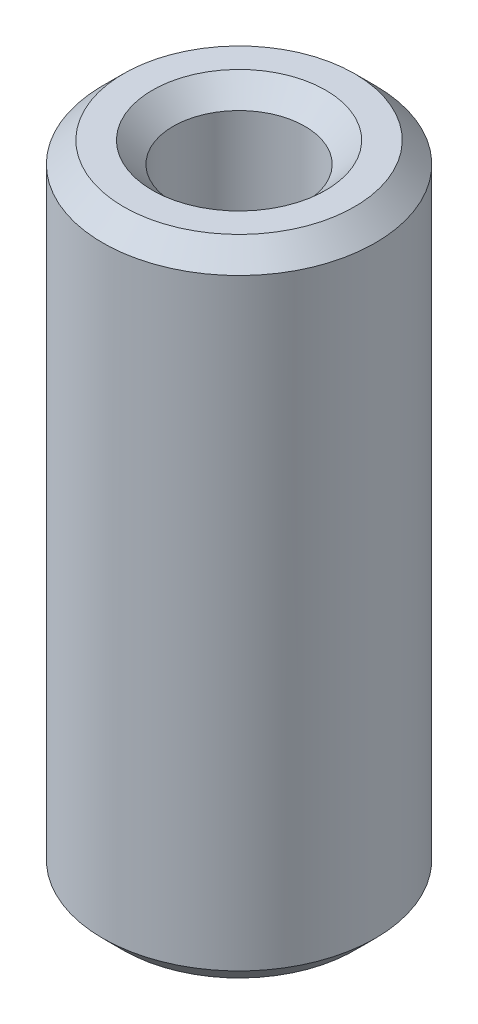
ISO-10303-21;
HEADER;
FILE_DESCRIPTION(('STEP AP214'),'2;1');
FILE_NAME('part.step','',(''),(''),'','','');
FILE_SCHEMA(('AUTOMOTIVE_DESIGN { 1 0 10303 214 1 1 1 1 }'));
ENDSEC;
DATA;
#1=APPLICATION_CONTEXT('core data for automotive mechanical design processes');
#2=APPLICATION_PROTOCOL_DEFINITION('international standard','automotive_design',2000,#1);
#3=PRODUCT_CONTEXT('',#1,'mechanical');
#4=PRODUCT('Part','Part','',(#3));
#5=PRODUCT_RELATED_PRODUCT_CATEGORY('part','',(#4));
#6=PRODUCT_DEFINITION_FORMATION('','',#4);
#7=PRODUCT_DEFINITION_CONTEXT('part definition',#1,'design');
#8=PRODUCT_DEFINITION('design','',#6,#7);
#9=PRODUCT_DEFINITION_SHAPE('','',#8);
#10=(LENGTH_UNIT() NAMED_UNIT(*) SI_UNIT(.MILLI.,.METRE.));
#11=(NAMED_UNIT(*) PLANE_ANGLE_UNIT() SI_UNIT($,.RADIAN.));
#12=(NAMED_UNIT(*) SI_UNIT($,.STERADIAN.) SOLID_ANGLE_UNIT());
#13=UNCERTAINTY_MEASURE_WITH_UNIT(LENGTH_MEASURE(1.E-05),#10,'distance_accuracy_value','');
#14=(GEOMETRIC_REPRESENTATION_CONTEXT(3) GLOBAL_UNCERTAINTY_ASSIGNED_CONTEXT((#13)) GLOBAL_UNIT_ASSIGNED_CONTEXT((#10,
#11,#12)) REPRESENTATION_CONTEXT('',''));
#15=CARTESIAN_POINT('',(0.,0.,0.));
#16=DIRECTION('',(0.,0.,1.));
#17=DIRECTION('',(1.,0.,0.));
#18=AXIS2_PLACEMENT_3D('',#15,#16,#17);
#19=CARTESIAN_POINT('',(0.,23.6281511873177,0.));
#20=DIRECTION('',(0.,-1.,0.));
#21=DIRECTION('',(0.,0.,-1.));
#22=AXIS2_PLACEMENT_3D('',#19,#20,#21);
#23=CYLINDRICAL_SURFACE('',#22,5.);
#24=CARTESIAN_POINT('',(0.,0.764984297765083,0.));
#25=DIRECTION('',(0.,1.,0.));
#26=DIRECTION('',(0.,0.,1.));
#27=AXIS2_PLACEMENT_3D('',#24,#25,#26);
#28=CIRCLE('',#27,5.);
#29=CARTESIAN_POINT('',(0.,0.764984297765083,5.));
#30=VERTEX_POINT('',#29);
#31=EDGE_CURVE('E10',#30,#30,#28,.T.);
#32=ORIENTED_EDGE('',*,*,#31,.T.);
#33=EDGE_LOOP('',(#32));
#34=FACE_BOUND('',#33,.T.);
#35=CARTESIAN_POINT('',(0.,22.8631668895526,0.));
#36=DIRECTION('',(0.,1.,0.));
#37=DIRECTION('',(0.,0.,1.));
#38=AXIS2_PLACEMENT_3D('',#35,#36,#37);
#39=CIRCLE('',#38,5.);
#40=CARTESIAN_POINT('',(0.,22.8631668895526,-5.));
#41=VERTEX_POINT('',#40);
#42=EDGE_CURVE('E50',#41,#41,#39,.F.);
#43=ORIENTED_EDGE('',*,*,#42,.T.);
#44=EDGE_LOOP('',(#43));
#45=FACE_BOUND('',#44,.T.);
#46=ADVANCED_FACE('F39',(#34,#45),#23,.T.);
#47=CARTESIAN_POINT('',(0.,23.6281511873177,0.));
#48=DIRECTION('',(0.,1.,0.));
#49=DIRECTION('',(0.,0.,1.));
#50=AXIS2_PLACEMENT_3D('',#47,#48,#49);
#51=PLANE('',#50);
#52=CARTESIAN_POINT('',(0.,23.6281511873177,0.));
#53=DIRECTION('',(0.,1.,0.));
#54=DIRECTION('',(0.,0.,1.));
#55=AXIS2_PLACEMENT_3D('',#52,#53,#54);
#56=CIRCLE('',#55,3.18186007579578);
#57=CARTESIAN_POINT('',(0.,23.6281511873177,3.18186007579578));
#58=VERTEX_POINT('',#57);
#59=EDGE_CURVE('E58',#58,#58,#56,.F.);
#60=ORIENTED_EDGE('',*,*,#59,.T.);
#61=EDGE_LOOP('',(#60));
#62=FACE_BOUND('',#61,.T.);
#63=CARTESIAN_POINT('',(0.,23.6281511873177,0.));
#64=DIRECTION('',(0.,1.,0.));
#65=DIRECTION('',(0.,0.,1.));
#66=AXIS2_PLACEMENT_3D('',#63,#64,#65);
#67=CIRCLE('',#66,4.23501570223493);
#68=CARTESIAN_POINT('',(0.,23.6281511873177,-4.23501570223493));
#69=VERTEX_POINT('',#68);
#70=EDGE_CURVE('E61',#69,#69,#67,.T.);
#71=ORIENTED_EDGE('',*,*,#70,.T.);
#72=EDGE_LOOP('',(#71));
#73=FACE_BOUND('',#72,.T.);
#74=ADVANCED_FACE('F88',(#62,#73),#51,.T.);
#75=CARTESIAN_POINT('',(0.,0.,0.));
#76=DIRECTION('',(0.,1.,0.));
#77=DIRECTION('',(0.,0.,1.));
#78=AXIS2_PLACEMENT_3D('',#75,#76,#77);
#79=PLANE('',#78);
#80=CARTESIAN_POINT('',(0.,0.,0.));
#81=DIRECTION('',(0.,1.,0.));
#82=DIRECTION('',(0.,0.,1.));
#83=AXIS2_PLACEMENT_3D('',#80,#81,#82);
#84=CIRCLE('',#83,3.18186007579577);
#85=CARTESIAN_POINT('',(0.,0.,3.18186007579577));
#86=VERTEX_POINT('',#85);
#87=EDGE_CURVE('E51',#86,#86,#84,.T.);
#88=ORIENTED_EDGE('',*,*,#87,.T.);
#89=EDGE_LOOP('',(#88));
#90=FACE_BOUND('',#89,.T.);
#91=CARTESIAN_POINT('',(0.,0.,0.));
#92=DIRECTION('',(0.,1.,0.));
#93=DIRECTION('',(0.,0.,1.));
#94=AXIS2_PLACEMENT_3D('',#91,#92,#93);
#95=CIRCLE('',#94,4.23501570223491);
#96=CARTESIAN_POINT('',(0.,0.,4.23501570223491));
#97=VERTEX_POINT('',#96);
#98=EDGE_CURVE('E54',#97,#97,#95,.F.);
#99=ORIENTED_EDGE('',*,*,#98,.T.);
#100=EDGE_LOOP('',(#99));
#101=FACE_BOUND('',#100,.T.);
#102=ADVANCED_FACE('F83',(#90,#101),#79,.F.);
#103=CARTESIAN_POINT('',(0.,23.6281511873177,0.));
#104=DIRECTION('',(0.,-1.,0.));
#105=DIRECTION('',(0.,0.,-1.));
#106=AXIS2_PLACEMENT_3D('',#103,#104,#105);
#107=CYLINDRICAL_SURFACE('',#106,2.41687577803069);
#108=CARTESIAN_POINT('',(0.,22.8631668895526,0.));
#109=DIRECTION('',(0.,1.,0.));
#110=DIRECTION('',(0.,0.,1.));
#111=AXIS2_PLACEMENT_3D('',#108,#109,#110);
#112=CIRCLE('',#111,2.41687577803069);
#113=CARTESIAN_POINT('',(0.,22.8631668895526,2.41687577803069));
#114=VERTEX_POINT('',#113);
#115=EDGE_CURVE('E67',#114,#114,#112,.T.);
#116=ORIENTED_EDGE('',*,*,#115,.T.);
#117=EDGE_LOOP('',(#116));
#118=FACE_BOUND('',#117,.T.);
#119=CARTESIAN_POINT('',(0.,0.764984297765087,0.));
#120=DIRECTION('',(0.,1.,0.));
#121=DIRECTION('',(0.,0.,1.));
#122=AXIS2_PLACEMENT_3D('',#119,#120,#121);
#123=CIRCLE('',#122,2.41687577803069);
#124=CARTESIAN_POINT('',(0.,0.764984297765087,2.41687577803069));
#125=VERTEX_POINT('',#124);
#126=EDGE_CURVE('E69',#125,#125,#123,.F.);
#127=ORIENTED_EDGE('',*,*,#126,.T.);
#128=EDGE_LOOP('',(#127));
#129=FACE_BOUND('',#128,.T.);
#130=ADVANCED_FACE('F71',(#118,#129),#107,.F.);
#131=CARTESIAN_POINT('',(0.,22.8631668895526,0.));
#132=DIRECTION('',(0.,1.,0.));
#133=DIRECTION('',(0.,0.,1.));
#134=AXIS2_PLACEMENT_3D('',#131,#132,#133);
#135=CONICAL_SURFACE('',#134,2.41687577803069,0.785398163397455);
#136=CARTESIAN_POINT('',(0.,23.6281511873177,3.18186007579578));
#137=CARTESIAN_POINT('',(0.,23.6201826008827,3.17389148936072));
#138=CARTESIAN_POINT('',(0.,23.6122140144476,3.16592290292567));
#139=CARTESIAN_POINT('',(0.,23.5962768415775,3.14998573005556));
#140=CARTESIAN_POINT('',(0.,23.5883082551425,3.14201714362051));
#141=CARTESIAN_POINT('',(0.,23.5723710822724,3.1260799707504));
#142=CARTESIAN_POINT('',(0.,23.5644024958373,3.11811138431535));
#143=CARTESIAN_POINT('',(0.,23.5484653229672,3.10217421144525));
#144=CARTESIAN_POINT('',(0.,23.5404967365321,3.09420562501019));
#145=CARTESIAN_POINT('',(0.,23.524559563662,3.07826845214009));
#146=CARTESIAN_POINT('',(0.,23.516590977227,3.07029986570503));
#147=CARTESIAN_POINT('',(0.,23.5006538043569,3.05436269283493));
#148=CARTESIAN_POINT('',(0.,23.4926852179218,3.04639410639987));
#149=CARTESIAN_POINT('',(0.,23.4767480450517,3.03045693352977));
#150=CARTESIAN_POINT('',(0.,23.4687794586167,3.02248834709472));
#151=CARTESIAN_POINT('',(0.,23.4528422857466,3.00655117422461));
#152=CARTESIAN_POINT('',(0.,23.4448736993115,2.99858258778956));
#153=CARTESIAN_POINT('',(0.,23.4289365264414,2.98264541491945));
#154=CARTESIAN_POINT('',(0.,23.4209679400063,2.9746768284844));
#155=CARTESIAN_POINT('',(0.,23.4050307671362,2.95873965561429));
#156=CARTESIAN_POINT('',(0.,23.3970621807012,2.95077106917924));
#157=CARTESIAN_POINT('',(0.,23.3811250078311,2.93483389630913));
#158=CARTESIAN_POINT('',(0.,23.373156421396,2.92686530987408));
#159=CARTESIAN_POINT('',(0.,23.3572192485259,2.91092813700397));
#160=CARTESIAN_POINT('',(0.,23.3492506620909,2.90295955056892));
#161=CARTESIAN_POINT('',(0.,23.3333134892208,2.88702237769882));
#162=CARTESIAN_POINT('',(0.,23.3253449027857,2.87905379126376));
#163=CARTESIAN_POINT('',(0.,23.3094077299156,2.86311661839366));
#164=CARTESIAN_POINT('',(0.,23.3014391434806,2.8551480319586));
#165=CARTESIAN_POINT('',(0.,23.2855019706104,2.8392108590885));
#166=CARTESIAN_POINT('',(0.,23.2775333841754,2.83124227265344));
#167=CARTESIAN_POINT('',(0.,23.2615962113053,2.81530509978334));
#168=CARTESIAN_POINT('',(0.,23.2536276248702,2.80733651334829));
#169=CARTESIAN_POINT('',(0.,23.2376904520001,2.79139934047818));
#170=CARTESIAN_POINT('',(0.,23.2297218655651,2.78343075404313));
#171=CARTESIAN_POINT('',(0.,23.213784692695,2.76749358117302));
#172=CARTESIAN_POINT('',(0.,23.2058161062599,2.75952499473797));
#173=CARTESIAN_POINT('',(0.,23.1898789333898,2.74358782186786));
#174=CARTESIAN_POINT('',(0.,23.1819103469548,2.73561923543281));
#175=CARTESIAN_POINT('',(0.,23.1659731740847,2.7196820625627));
#176=CARTESIAN_POINT('',(0.,23.1580045876496,2.71171347612765));
#177=CARTESIAN_POINT('',(0.,23.1420674147795,2.69577630325754));
#178=CARTESIAN_POINT('',(0.,23.1340988283444,2.68780771682249));
#179=CARTESIAN_POINT('',(0.,23.1181616554743,2.67187054395238));
#180=CARTESIAN_POINT('',(0.,23.1101930690393,2.66390195751733));
#181=CARTESIAN_POINT('',(0.,23.0942558961692,2.64796478464723));
#182=CARTESIAN_POINT('',(0.,23.0862873097341,2.63999619821217));
#183=CARTESIAN_POINT('',(0.,23.070350136864,2.62405902534207));
#184=CARTESIAN_POINT('',(0.,23.062381550429,2.61609043890701));
#185=CARTESIAN_POINT('',(0.,23.0464443775589,2.60015326603691));
#186=CARTESIAN_POINT('',(0.,23.0384757911238,2.59218467960185));
#187=CARTESIAN_POINT('',(0.,23.0225386182537,2.57624750673175));
#188=CARTESIAN_POINT('',(0.,23.0145700318186,2.5682789202967));
#189=CARTESIAN_POINT('',(0.,22.9986328589485,2.55234174742659));
#190=CARTESIAN_POINT('',(0.,22.9906642725135,2.54437316099154));
#191=CARTESIAN_POINT('',(0.,22.9747270996434,2.52843598812143));
#192=CARTESIAN_POINT('',(0.,22.9667585132083,2.52046740168638));
#193=CARTESIAN_POINT('',(0.,22.9508213403382,2.50453022881627));
#194=CARTESIAN_POINT('',(0.,22.9428527539032,2.49656164238122));
#195=CARTESIAN_POINT('',(0.,22.9269155810331,2.48062446951111));
#196=CARTESIAN_POINT('',(0.,22.918946994598,2.47265588307606));
#197=CARTESIAN_POINT('',(0.,22.9030098217279,2.45671871020595));
#198=CARTESIAN_POINT('',(0.,22.8950412352929,2.4487501237709));
#199=CARTESIAN_POINT('',(0.,22.8791040624228,2.4328129509008));
#200=CARTESIAN_POINT('',(0.,22.8711354759877,2.42484436446574));
#201=CARTESIAN_POINT('',(0.,22.8631668895526,2.41687577803069));
#202=B_SPLINE_CURVE_WITH_KNOTS('',3,(#136,#137,#138,#139,#140,#141,#142,#143,#144,#145,#146,
#147,#148,#149,#150,#151,#152,#153,#154,#155,#156,#157,#158,#159,#160,#161,#162,#163,#164,#165,
#166,#167,#168,#169,#170,#171,#172,#173,#174,#175,#176,#177,#178,#179,#180,#181,#182,#183,#184,
#185,#186,#187,#188,#189,#190,#191,#192,#193,#194,#195,#196,#197,#198,#199,#200,#201),
.UNSPECIFIED.,.F.,.F.,(4,2,2,2,2,2,2,2,2,2,2,2,2,2,2,2,2,2,2,2,2,2,2,2,2,2,2,2,2,2,2,2,4),(0.,
0.033807849028182,0.067615698056364,0.101423547084546,0.135231396112728,0.16903924514091,
0.202847094169092,0.236654943197276,0.270462792225458,0.304270641253641,0.338078490281823,
0.371886339310005,0.405694188338187,0.439502037366371,0.473309886394553,0.507117735422735,
0.540925584450917,0.574733433479099,0.608541282507281,0.642349131535463,0.676156980563648,
0.70996482959183,0.743772678620012,0.777580527648194,0.811388376676376,0.845196225704558,
0.879004074732742,0.912811923760924,0.946619772789106,0.980427621817288,1.01423547084547,
1.04804331987365,1.08185116890183),.UNSPECIFIED.);
#203=EDGE_CURVE('BSEAM77',#58,#114,#202,.T.);
#204=ORIENTED_EDGE('',*,*,#59,.F.);
#205=ORIENTED_EDGE('',*,*,#115,.F.);
#206=ORIENTED_EDGE('',*,*,#203,.T.);
#207=ORIENTED_EDGE('',*,*,#203,.F.);
#208=EDGE_LOOP('',(#204,#206,#205,#207));
#209=FACE_BOUND('',#208,.T.);
#210=ADVANCED_FACE('F77',(#209),#135,.F.);
#211=CARTESIAN_POINT('',(0.,0.,0.));
#212=DIRECTION('',(0.,-1.,0.));
#213=DIRECTION('',(0.,0.,-1.));
#214=AXIS2_PLACEMENT_3D('',#211,#212,#213);
#215=CONICAL_SURFACE('',#214,3.18186007579577,0.785398163397446);
#216=ORIENTED_EDGE('',*,*,#126,.F.);
#217=EDGE_LOOP('',(#216));
#218=FACE_BOUND('',#217,.T.);
#219=ORIENTED_EDGE('',*,*,#87,.F.);
#220=EDGE_LOOP('',(#219));
#221=FACE_BOUND('',#220,.T.);
#222=ADVANCED_FACE('F73',(#218,#221),#215,.F.);
#223=CARTESIAN_POINT('',(0.,0.764984297765083,0.));
#224=DIRECTION('',(0.,1.,0.));
#225=DIRECTION('',(0.,0.,1.));
#226=AXIS2_PLACEMENT_3D('',#223,#224,#225);
#227=CONICAL_SURFACE('',#226,5.,0.785398163397451);
#228=ORIENTED_EDGE('',*,*,#98,.F.);
#229=EDGE_LOOP('',(#228));
#230=FACE_BOUND('',#229,.T.);
#231=ORIENTED_EDGE('',*,*,#31,.F.);
#232=EDGE_LOOP('',(#231));
#233=FACE_BOUND('',#232,.T.);
#234=ADVANCED_FACE('F76',(#230,#233),#227,.T.);
#235=CARTESIAN_POINT('',(0.,23.6281511873177,0.));
#236=DIRECTION('',(0.,-1.,0.));
#237=DIRECTION('',(0.,0.,-1.));
#238=AXIS2_PLACEMENT_3D('',#235,#236,#237);
#239=CONICAL_SURFACE('',#238,4.23501570223493,0.785398163397445);
#240=CARTESIAN_POINT('',(0.,22.8631668895526,-5.));
#241=CARTESIAN_POINT('',(0.,22.8711354759877,-4.99203141356495));
#242=CARTESIAN_POINT('',(0.,22.8791040624227,-4.9840628271299));
#243=CARTESIAN_POINT('',(0.,22.8950412352929,-4.96812565425979));
#244=CARTESIAN_POINT('',(0.,22.9030098217279,-4.96015706782474));
#245=CARTESIAN_POINT('',(0.,22.918946994598,-4.94421989495463));
#246=CARTESIAN_POINT('',(0.,22.9269155810331,-4.93625130851958));
#247=CARTESIAN_POINT('',(0.,22.9428527539032,-4.92031413564947));
#248=CARTESIAN_POINT('',(0.,22.9508213403382,-4.91234554921442));
#249=CARTESIAN_POINT('',(0.,22.9667585132083,-4.89640837634431));
#250=CARTESIAN_POINT('',(0.,22.9747270996434,-4.88843978990926));
#251=CARTESIAN_POINT('',(0.,22.9906642725135,-4.87250261703916));
#252=CARTESIAN_POINT('',(0.,22.9986328589485,-4.8645340306041));
#253=CARTESIAN_POINT('',(0.,23.0145700318186,-4.848596857734));
#254=CARTESIAN_POINT('',(0.,23.0225386182537,-4.84062827129894));
#255=CARTESIAN_POINT('',(0.,23.0384757911238,-4.82469109842884));
#256=CARTESIAN_POINT('',(0.,23.0464443775589,-4.81672251199379));
#257=CARTESIAN_POINT('',(0.,23.062381550429,-4.80078533912368));
#258=CARTESIAN_POINT('',(0.,23.070350136864,-4.79281675268863));
#259=CARTESIAN_POINT('',(0.,23.0862873097341,-4.77687957981852));
#260=CARTESIAN_POINT('',(0.,23.0942558961692,-4.76891099338347));
#261=CARTESIAN_POINT('',(0.,23.1101930690393,-4.75297382051336));
#262=CARTESIAN_POINT('',(0.,23.1181616554743,-4.74500523407831));
#263=CARTESIAN_POINT('',(0.,23.1340988283444,-4.72906806120821));
#264=CARTESIAN_POINT('',(0.,23.1420674147795,-4.72109947477315));
#265=CARTESIAN_POINT('',(0.,23.1580045876496,-4.70516230190305));
#266=CARTESIAN_POINT('',(0.,23.1659731740847,-4.69719371546799));
#267=CARTESIAN_POINT('',(0.,23.1819103469548,-4.68125654259789));
#268=CARTESIAN_POINT('',(0.,23.1898789333898,-4.67328795616283));
#269=CARTESIAN_POINT('',(0.,23.2058161062599,-4.65735078329273));
#270=CARTESIAN_POINT('',(0.,23.213784692695,-4.64938219685768));
#271=CARTESIAN_POINT('',(0.,23.2297218655651,-4.63344502398757));
#272=CARTESIAN_POINT('',(0.,23.2376904520001,-4.62547643755252));
#273=CARTESIAN_POINT('',(0.,23.2536276248702,-4.60953926468241));
#274=CARTESIAN_POINT('',(0.,23.2615962113053,-4.60157067824736));
#275=CARTESIAN_POINT('',(0.,23.2775333841754,-4.58563350537725));
#276=CARTESIAN_POINT('',(0.,23.2855019706104,-4.5776649189422));
#277=CARTESIAN_POINT('',(0.,23.3014391434806,-4.56172774607209));
#278=CARTESIAN_POINT('',(0.,23.3094077299156,-4.55375915963704));
#279=CARTESIAN_POINT('',(0.,23.3253449027857,-4.53782198676694));
#280=CARTESIAN_POINT('',(0.,23.3333134892208,-4.52985340033188));
#281=CARTESIAN_POINT('',(0.,23.3492506620909,-4.51391622746178));
#282=CARTESIAN_POINT('',(0.,23.3572192485259,-4.50594764102672));
#283=CARTESIAN_POINT('',(0.,23.373156421396,-4.49001046815662));
#284=CARTESIAN_POINT('',(0.,23.3811250078311,-4.48204188172157));
#285=CARTESIAN_POINT('',(0.,23.3970621807012,-4.46610470885146));
#286=CARTESIAN_POINT('',(0.,23.4050307671362,-4.45813612241641));
#287=CARTESIAN_POINT('',(0.,23.4209679400063,-4.4421989495463));
#288=CARTESIAN_POINT('',(0.,23.4289365264414,-4.43423036311125));
#289=CARTESIAN_POINT('',(0.,23.4448736993115,-4.41829319024114));
#290=CARTESIAN_POINT('',(0.,23.4528422857466,-4.41032460380609));
#291=CARTESIAN_POINT('',(0.,23.4687794586167,-4.39438743093598));
#292=CARTESIAN_POINT('',(0.,23.4767480450517,-4.38641884450093));
#293=CARTESIAN_POINT('',(0.,23.4926852179218,-4.37048167163083));
#294=CARTESIAN_POINT('',(0.,23.5006538043569,-4.36251308519577));
#295=CARTESIAN_POINT('',(0.,23.516590977227,-4.34657591232567));
#296=CARTESIAN_POINT('',(0.,23.524559563662,-4.33860732589061));
#297=CARTESIAN_POINT('',(0.,23.5404967365321,-4.32267015302051));
#298=CARTESIAN_POINT('',(0.,23.5484653229672,-4.31470156658546));
#299=CARTESIAN_POINT('',(0.,23.5644024958373,-4.29876439371535));
#300=CARTESIAN_POINT('',(0.,23.5723710822724,-4.2907958072803));
#301=CARTESIAN_POINT('',(0.,23.5883082551425,-4.27485863441019));
#302=CARTESIAN_POINT('',(0.,23.5962768415775,-4.26689004797514));
#303=CARTESIAN_POINT('',(0.,23.6122140144476,-4.25095287510503));
#304=CARTESIAN_POINT('',(0.,23.6201826008827,-4.24298428866998));
#305=CARTESIAN_POINT('',(0.,23.6281511873177,-4.23501570223493));
#306=B_SPLINE_CURVE_WITH_KNOTS('',3,(#240,#241,#242,#243,#244,#245,#246,#247,#248,#249,#250,
#251,#252,#253,#254,#255,#256,#257,#258,#259,#260,#261,#262,#263,#264,#265,#266,#267,#268,#269,
#270,#271,#272,#273,#274,#275,#276,#277,#278,#279,#280,#281,#282,#283,#284,#285,#286,#287,#288,
#289,#290,#291,#292,#293,#294,#295,#296,#297,#298,#299,#300,#301,#302,#303,#304,#305),
.UNSPECIFIED.,.F.,.F.,(4,2,2,2,2,2,2,2,2,2,2,2,2,2,2,2,2,2,2,2,2,2,2,2,2,2,2,2,2,2,2,2,4),(0.,
0.0338078490281838,0.0676156980563658,0.101423547084548,0.135231396112729,0.169039245140911,
0.202847094169095,0.236654943197277,0.270462792225459,0.30427064125364,0.338078490281822,
0.371886339310006,0.405694188338188,0.43950203736637,0.473309886394552,0.507117735422734,
0.540925584450915,0.5747334334791,0.608541282507282,0.642349131535463,0.676156980563645,
0.709964829591826,0.743772678620011,0.777580527648193,0.811388376676374,0.845196225704556,
0.879004074732738,0.912811923760922,0.946619772789104,0.980427621817285,1.01423547084547,
1.04804331987365,1.08185116890183),.UNSPECIFIED.);
#307=EDGE_CURVE('BSEAM45',#41,#69,#306,.T.);
#308=ORIENTED_EDGE('',*,*,#42,.F.);
#309=ORIENTED_EDGE('',*,*,#70,.F.);
#310=ORIENTED_EDGE('',*,*,#307,.T.);
#311=ORIENTED_EDGE('',*,*,#307,.F.);
#312=EDGE_LOOP('',(#308,#310,#309,#311));
#313=FACE_BOUND('',#312,.T.);
#314=ADVANCED_FACE('F45',(#313),#239,.T.);
#315=CLOSED_SHELL('',(#46,#74,#102,#130,#210,#222,#234,#314));
#316=MANIFOLD_SOLID_BREP('B2',#315);
#317=ADVANCED_BREP_SHAPE_REPRESENTATION('',(#18,#316),#14);
#318=SHAPE_DEFINITION_REPRESENTATION(#9,#317);
ENDSEC;
END-ISO-10303-21;
